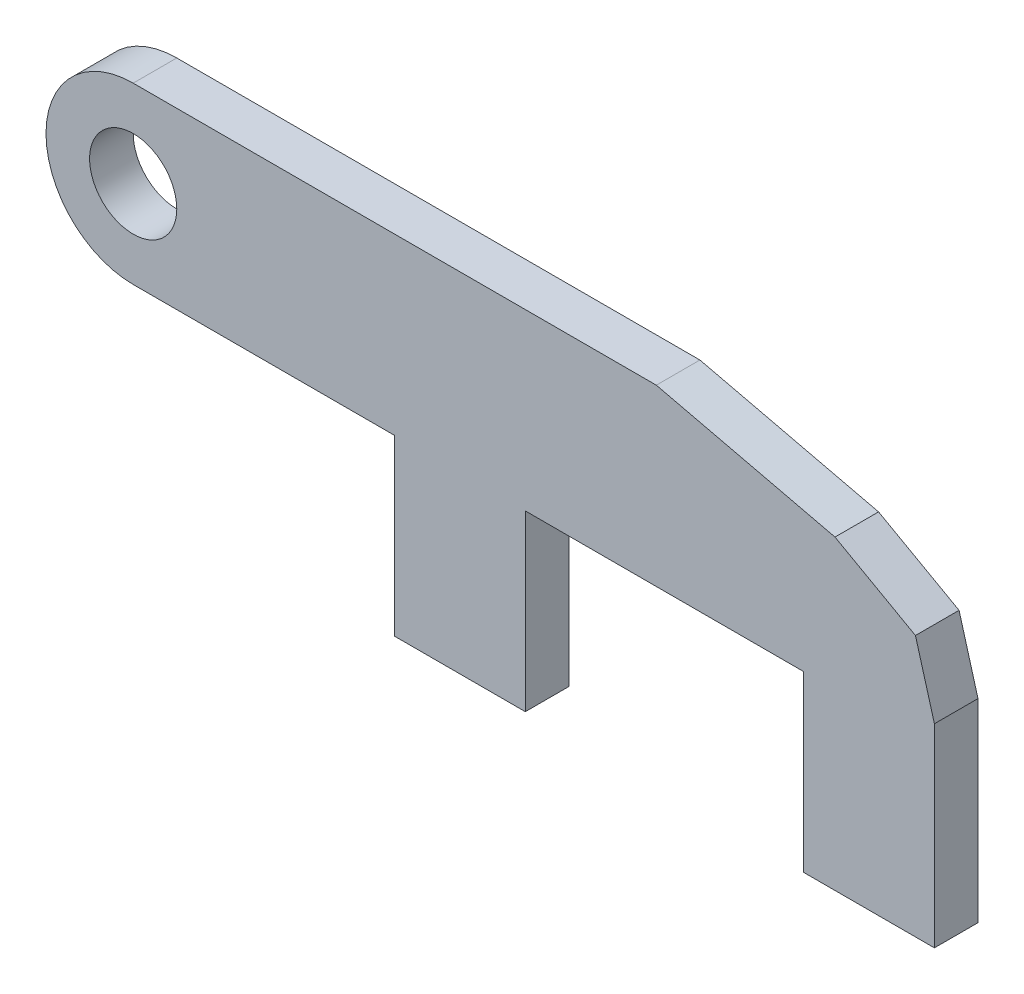
ISO-10303-21;
HEADER;
FILE_DESCRIPTION(('STEP AP214'),'2;1');
FILE_NAME('part.step','',(''),(''),'','','');
FILE_SCHEMA(('AUTOMOTIVE_DESIGN { 1 0 10303 214 1 1 1 1 }'));
ENDSEC;
DATA;
#1=APPLICATION_CONTEXT('core data for automotive mechanical design processes');
#2=APPLICATION_PROTOCOL_DEFINITION('international standard','automotive_design',2000,#1);
#3=PRODUCT_CONTEXT('',#1,'mechanical');
#4=PRODUCT('Part','Part','',(#3));
#5=PRODUCT_RELATED_PRODUCT_CATEGORY('part','',(#4));
#6=PRODUCT_DEFINITION_FORMATION('','',#4);
#7=PRODUCT_DEFINITION_CONTEXT('part definition',#1,'design');
#8=PRODUCT_DEFINITION('design','',#6,#7);
#9=PRODUCT_DEFINITION_SHAPE('','',#8);
#10=(LENGTH_UNIT() NAMED_UNIT(*) SI_UNIT(.MILLI.,.METRE.));
#11=(NAMED_UNIT(*) PLANE_ANGLE_UNIT() SI_UNIT($,.RADIAN.));
#12=(NAMED_UNIT(*) SI_UNIT($,.STERADIAN.) SOLID_ANGLE_UNIT());
#13=UNCERTAINTY_MEASURE_WITH_UNIT(LENGTH_MEASURE(1.E-05),#10,'distance_accuracy_value','');
#14=(GEOMETRIC_REPRESENTATION_CONTEXT(3) GLOBAL_UNCERTAINTY_ASSIGNED_CONTEXT((#13)) GLOBAL_UNIT_ASSIGNED_CONTEXT((#10,
#11,#12)) REPRESENTATION_CONTEXT('',''));
#15=CARTESIAN_POINT('',(0.,0.,0.));
#16=DIRECTION('',(0.,0.,1.));
#17=DIRECTION('',(1.,0.,0.));
#18=AXIS2_PLACEMENT_3D('',#15,#16,#17);
#19=CARTESIAN_POINT('',(0.,10.,5.));
#20=DIRECTION('',(0.,0.,1.));
#21=DIRECTION('',(1.,0.,0.));
#22=AXIS2_PLACEMENT_3D('',#19,#20,#21);
#23=PLANE('',#22);
#24=CARTESIAN_POINT('',(0.,10.,5.));
#25=DIRECTION('',(0.,0.,1.));
#26=DIRECTION('',(1.,0.,0.));
#27=AXIS2_PLACEMENT_3D('',#24,#25,#26);
#28=CIRCLE('',#27,10.);
#29=CARTESIAN_POINT('',(0.,20.,5.));
#30=VERTEX_POINT('',#29);
#31=CARTESIAN_POINT('',(0.,0.,5.));
#32=VERTEX_POINT('',#31);
#33=EDGE_CURVE('E186',#30,#32,#28,.T.);
#34=ORIENTED_EDGE('',*,*,#33,.T.);
#35=DIRECTION('',(1.,0.,0.));
#36=VECTOR('',#35,1.);
#37=CARTESIAN_POINT('',(29.9762595505053,0.,5.));
#38=LINE('',#37,#36);
#39=CARTESIAN_POINT('',(29.9762595505053,0.,5.));
#40=VERTEX_POINT('',#39);
#41=EDGE_CURVE('E109',#32,#40,#38,.T.);
#42=ORIENTED_EDGE('',*,*,#41,.T.);
#43=DIRECTION('',(0.,-1.,0.));
#44=VECTOR('',#43,1.);
#45=CARTESIAN_POINT('',(29.9762595505053,-19.9462860409939,5.));
#46=LINE('',#45,#44);
#47=CARTESIAN_POINT('',(29.9762595505053,-19.9462860409939,5.));
#48=VERTEX_POINT('',#47);
#49=EDGE_CURVE('E216',#40,#48,#46,.T.);
#50=ORIENTED_EDGE('',*,*,#49,.T.);
#51=DIRECTION('',(1.,0.,0.));
#52=VECTOR('',#51,1.);
#53=CARTESIAN_POINT('',(44.9762595505053,-19.9462860409939,5.));
#54=LINE('',#53,#52);
#55=CARTESIAN_POINT('',(44.9762595505053,-19.9462860409939,5.));
#56=VERTEX_POINT('',#55);
#57=EDGE_CURVE('E235',#48,#56,#54,.T.);
#58=ORIENTED_EDGE('',*,*,#57,.T.);
#59=DIRECTION('',(0.,1.,0.));
#60=VECTOR('',#59,1.);
#61=CARTESIAN_POINT('',(44.9762595505053,0.,5.));
#62=LINE('',#61,#60);
#63=CARTESIAN_POINT('',(44.9762595505053,0.,5.));
#64=VERTEX_POINT('',#63);
#65=EDGE_CURVE('E232',#56,#64,#62,.T.);
#66=ORIENTED_EDGE('',*,*,#65,.T.);
#67=DIRECTION('',(1.,0.,0.));
#68=VECTOR('',#67,1.);
#69=CARTESIAN_POINT('',(76.8969693597363,0.,5.));
#70=LINE('',#69,#68);
#71=CARTESIAN_POINT('',(76.8969693597363,0.,5.));
#72=VERTEX_POINT('',#71);
#73=EDGE_CURVE('E234',#64,#72,#70,.T.);
#74=ORIENTED_EDGE('',*,*,#73,.T.);
#75=DIRECTION('',(0.,-1.,0.));
#76=VECTOR('',#75,1.);
#77=CARTESIAN_POINT('',(76.8969693597363,-19.9462860409939,5.));
#78=LINE('',#77,#76);
#79=CARTESIAN_POINT('',(76.8969693597363,-19.9462860409939,5.));
#80=VERTEX_POINT('',#79);
#81=EDGE_CURVE('E237',#72,#80,#78,.T.);
#82=ORIENTED_EDGE('',*,*,#81,.T.);
#83=DIRECTION('',(1.,0.,0.));
#84=VECTOR('',#83,1.);
#85=CARTESIAN_POINT('',(91.8969693597363,-19.9462860409939,5.));
#86=LINE('',#85,#84);
#87=CARTESIAN_POINT('',(91.8969693597363,-19.9462860409939,5.));
#88=VERTEX_POINT('',#87);
#89=EDGE_CURVE('E243',#80,#88,#86,.T.);
#90=ORIENTED_EDGE('',*,*,#89,.T.);
#91=DIRECTION('',(0.,1.,0.));
#92=VECTOR('',#91,1.);
#93=CARTESIAN_POINT('',(91.8969693597363,2.31701265850022,5.));
#94=LINE('',#93,#92);
#95=CARTESIAN_POINT('',(91.8969693597363,2.31701265850022,5.));
#96=VERTEX_POINT('',#95);
#97=EDGE_CURVE('E245',#88,#96,#94,.T.);
#98=ORIENTED_EDGE('',*,*,#97,.T.);
#99=DIRECTION('',(-0.272160563892523,0.96225185240752,0.));
#100=VECTOR('',#99,1.);
#101=CARTESIAN_POINT('',(89.7239351774585,10.,5.));
#102=LINE('',#101,#100);
#103=CARTESIAN_POINT('',(89.7239351774585,10.,5.));
#104=VERTEX_POINT('',#103);
#105=EDGE_CURVE('E143',#96,#104,#102,.T.);
#106=ORIENTED_EDGE('',*,*,#105,.T.);
#107=DIRECTION('',(-0.872861390346621,0.487968229746736,0.));
#108=VECTOR('',#107,1.);
#109=CARTESIAN_POINT('',(80.4934253930056,15.1602643546769,5.));
#110=LINE('',#109,#108);
#111=CARTESIAN_POINT('',(80.4934253930056,15.1602643546769,5.));
#112=VERTEX_POINT('',#111);
#113=EDGE_CURVE('E137',#104,#112,#110,.T.);
#114=ORIENTED_EDGE('',*,*,#113,.T.);
#115=DIRECTION('',(-0.973228871561118,0.229838124687514,0.));
#116=VECTOR('',#115,1.);
#117=CARTESIAN_POINT('',(60.,20.,5.));
#118=LINE('',#117,#116);
#119=CARTESIAN_POINT('',(60.,20.,5.));
#120=VERTEX_POINT('',#119);
#121=EDGE_CURVE('E141',#112,#120,#118,.T.);
#122=ORIENTED_EDGE('',*,*,#121,.T.);
#123=DIRECTION('',(-1.,0.,0.));
#124=VECTOR('',#123,1.);
#125=CARTESIAN_POINT('',(0.,20.,5.));
#126=LINE('',#125,#124);
#127=EDGE_CURVE('E51',#120,#30,#126,.T.);
#128=ORIENTED_EDGE('',*,*,#127,.T.);
#129=EDGE_LOOP('',(#34,#42,#50,#58,#66,#74,#82,#90,#98,#106,#114,#122,#128));
#130=FACE_BOUND('',#129,.T.);
#131=CARTESIAN_POINT('',(0.,10.,5.));
#132=DIRECTION('',(0.,0.,1.));
#133=DIRECTION('',(1.,0.,0.));
#134=AXIS2_PLACEMENT_3D('',#131,#132,#133);
#135=CIRCLE('',#134,5.);
#136=CARTESIAN_POINT('',(5.,10.,5.));
#137=VERTEX_POINT('',#136);
#138=EDGE_CURVE('E165',#137,#137,#135,.T.);
#139=ORIENTED_EDGE('',*,*,#138,.F.);
#140=EDGE_LOOP('',(#139));
#141=FACE_BOUND('',#140,.T.);
#142=ADVANCED_FACE('F34',(#130,#141),#23,.T.);
#143=CARTESIAN_POINT('',(0.,10.,0.));
#144=DIRECTION('',(0.,0.,1.));
#145=DIRECTION('',(1.,0.,0.));
#146=AXIS2_PLACEMENT_3D('',#143,#144,#145);
#147=PLANE('',#146);
#148=CARTESIAN_POINT('',(0.,10.,0.));
#149=DIRECTION('',(0.,0.,1.));
#150=DIRECTION('',(1.,0.,0.));
#151=AXIS2_PLACEMENT_3D('',#148,#149,#150);
#152=CIRCLE('',#151,10.);
#153=CARTESIAN_POINT('',(0.,20.,0.));
#154=VERTEX_POINT('',#153);
#155=CARTESIAN_POINT('',(0.,0.,0.));
#156=VERTEX_POINT('',#155);
#157=EDGE_CURVE('E161',#154,#156,#152,.T.);
#158=ORIENTED_EDGE('',*,*,#157,.F.);
#159=DIRECTION('',(-1.,0.,0.));
#160=VECTOR('',#159,1.);
#161=CARTESIAN_POINT('',(0.,20.,0.));
#162=LINE('',#161,#160);
#163=CARTESIAN_POINT('',(60.,20.,0.));
#164=VERTEX_POINT('',#163);
#165=EDGE_CURVE('E101',#164,#154,#162,.T.);
#166=ORIENTED_EDGE('',*,*,#165,.F.);
#167=DIRECTION('',(-0.973228871561118,0.229838124687514,0.));
#168=VECTOR('',#167,1.);
#169=CARTESIAN_POINT('',(60.,20.,0.));
#170=LINE('',#169,#168);
#171=CARTESIAN_POINT('',(80.4934253930056,15.1602643546769,0.));
#172=VERTEX_POINT('',#171);
#173=EDGE_CURVE('E95',#172,#164,#170,.T.);
#174=ORIENTED_EDGE('',*,*,#173,.F.);
#175=DIRECTION('',(-0.872861390346621,0.487968229746736,0.));
#176=VECTOR('',#175,1.);
#177=CARTESIAN_POINT('',(80.4934253930056,15.1602643546769,0.));
#178=LINE('',#177,#176);
#179=CARTESIAN_POINT('',(89.7239351774585,10.,0.));
#180=VERTEX_POINT('',#179);
#181=EDGE_CURVE('E151',#180,#172,#178,.T.);
#182=ORIENTED_EDGE('',*,*,#181,.F.);
#183=DIRECTION('',(-0.272160563892523,0.96225185240752,0.));
#184=VECTOR('',#183,1.);
#185=CARTESIAN_POINT('',(89.7239351774585,10.,0.));
#186=LINE('',#185,#184);
#187=CARTESIAN_POINT('',(91.8969693597363,2.31701265850022,0.));
#188=VERTEX_POINT('',#187);
#189=EDGE_CURVE('E181',#188,#180,#186,.T.);
#190=ORIENTED_EDGE('',*,*,#189,.F.);
#191=DIRECTION('',(0.,1.,0.));
#192=VECTOR('',#191,1.);
#193=CARTESIAN_POINT('',(91.8969693597363,2.31701265850022,0.));
#194=LINE('',#193,#192);
#195=CARTESIAN_POINT('',(91.8969693597363,-19.9462860409939,0.));
#196=VERTEX_POINT('',#195);
#197=EDGE_CURVE('E179',#196,#188,#194,.T.);
#198=ORIENTED_EDGE('',*,*,#197,.F.);
#199=DIRECTION('',(1.,0.,0.));
#200=VECTOR('',#199,1.);
#201=CARTESIAN_POINT('',(91.8969693597363,-19.9462860409939,0.));
#202=LINE('',#201,#200);
#203=CARTESIAN_POINT('',(76.8969693597363,-19.9462860409939,0.));
#204=VERTEX_POINT('',#203);
#205=EDGE_CURVE('E177',#204,#196,#202,.T.);
#206=ORIENTED_EDGE('',*,*,#205,.F.);
#207=DIRECTION('',(0.,-1.,0.));
#208=VECTOR('',#207,1.);
#209=CARTESIAN_POINT('',(76.8969693597363,-19.9462860409939,0.));
#210=LINE('',#209,#208);
#211=CARTESIAN_POINT('',(76.8969693597363,0.,0.));
#212=VERTEX_POINT('',#211);
#213=EDGE_CURVE('E175',#212,#204,#210,.T.);
#214=ORIENTED_EDGE('',*,*,#213,.F.);
#215=DIRECTION('',(1.,0.,0.));
#216=VECTOR('',#215,1.);
#217=CARTESIAN_POINT('',(76.8969693597363,0.,0.));
#218=LINE('',#217,#216);
#219=CARTESIAN_POINT('',(44.9762595505053,0.,0.));
#220=VERTEX_POINT('',#219);
#221=EDGE_CURVE('E173',#220,#212,#218,.T.);
#222=ORIENTED_EDGE('',*,*,#221,.F.);
#223=DIRECTION('',(0.,1.,0.));
#224=VECTOR('',#223,1.);
#225=CARTESIAN_POINT('',(44.9762595505053,0.,0.));
#226=LINE('',#225,#224);
#227=CARTESIAN_POINT('',(44.9762595505053,-19.9462860409939,0.));
#228=VERTEX_POINT('',#227);
#229=EDGE_CURVE('E171',#228,#220,#226,.T.);
#230=ORIENTED_EDGE('',*,*,#229,.F.);
#231=DIRECTION('',(1.,0.,0.));
#232=VECTOR('',#231,1.);
#233=CARTESIAN_POINT('',(44.9762595505053,-19.9462860409939,0.));
#234=LINE('',#233,#232);
#235=CARTESIAN_POINT('',(29.9762595505053,-19.9462860409939,0.));
#236=VERTEX_POINT('',#235);
#237=EDGE_CURVE('E169',#236,#228,#234,.T.);
#238=ORIENTED_EDGE('',*,*,#237,.F.);
#239=DIRECTION('',(0.,-1.,0.));
#240=VECTOR('',#239,1.);
#241=CARTESIAN_POINT('',(29.9762595505053,-19.9462860409939,0.));
#242=LINE('',#241,#240);
#243=CARTESIAN_POINT('',(29.9762595505053,0.,0.));
#244=VERTEX_POINT('',#243);
#245=EDGE_CURVE('E167',#244,#236,#242,.T.);
#246=ORIENTED_EDGE('',*,*,#245,.F.);
#247=DIRECTION('',(1.,0.,0.));
#248=VECTOR('',#247,1.);
#249=CARTESIAN_POINT('',(29.9762595505053,0.,0.));
#250=LINE('',#249,#248);
#251=EDGE_CURVE('E164',#156,#244,#250,.T.);
#252=ORIENTED_EDGE('',*,*,#251,.F.);
#253=EDGE_LOOP('',(#158,#166,#174,#182,#190,#198,#206,#214,#222,#230,#238,#246,#252));
#254=FACE_BOUND('',#253,.T.);
#255=CARTESIAN_POINT('',(0.,10.,0.));
#256=DIRECTION('',(0.,0.,1.));
#257=DIRECTION('',(1.,0.,0.));
#258=AXIS2_PLACEMENT_3D('',#255,#256,#257);
#259=CIRCLE('',#258,5.);
#260=CARTESIAN_POINT('',(5.,10.,0.));
#261=VERTEX_POINT('',#260);
#262=EDGE_CURVE('E435',#261,#261,#259,.T.);
#263=ORIENTED_EDGE('',*,*,#262,.T.);
#264=EDGE_LOOP('',(#263));
#265=FACE_BOUND('',#264,.T.);
#266=ADVANCED_FACE('F220',(#254,#265),#147,.F.);
#267=CARTESIAN_POINT('',(0.,10.,5.));
#268=DIRECTION('',(0.,0.,-1.));
#269=DIRECTION('',(-1.,0.,0.));
#270=AXIS2_PLACEMENT_3D('',#267,#268,#269);
#271=CYLINDRICAL_SURFACE('',#270,10.);
#272=ORIENTED_EDGE('',*,*,#157,.T.);
#273=DIRECTION('',(0.,0.,-1.));
#274=VECTOR('',#273,1.);
#275=CARTESIAN_POINT('',(0.,0.,5.));
#276=LINE('',#275,#274);
#277=EDGE_CURVE('E11',#32,#156,#276,.T.);
#278=ORIENTED_EDGE('',*,*,#277,.F.);
#279=ORIENTED_EDGE('',*,*,#33,.F.);
#280=DIRECTION('',(0.,0.,-1.));
#281=VECTOR('',#280,1.);
#282=CARTESIAN_POINT('',(0.,20.,5.));
#283=LINE('',#282,#281);
#284=EDGE_CURVE('E157',#30,#154,#283,.T.);
#285=ORIENTED_EDGE('',*,*,#284,.T.);
#286=EDGE_LOOP('',(#272,#278,#279,#285));
#287=FACE_BOUND('',#286,.T.);
#288=ADVANCED_FACE('F36',(#287),#271,.T.);
#289=CARTESIAN_POINT('',(29.9762595505053,0.,5.));
#290=DIRECTION('',(0.,1.,0.));
#291=DIRECTION('',(0.,0.,1.));
#292=AXIS2_PLACEMENT_3D('',#289,#290,#291);
#293=PLANE('',#292);
#294=ORIENTED_EDGE('',*,*,#251,.T.);
#295=DIRECTION('',(0.,0.,-1.));
#296=VECTOR('',#295,1.);
#297=CARTESIAN_POINT('',(29.9762595505053,0.,5.));
#298=LINE('',#297,#296);
#299=EDGE_CURVE('E43',#40,#244,#298,.T.);
#300=ORIENTED_EDGE('',*,*,#299,.F.);
#301=ORIENTED_EDGE('',*,*,#41,.F.);
#302=ORIENTED_EDGE('',*,*,#277,.T.);
#303=EDGE_LOOP('',(#294,#300,#301,#302));
#304=FACE_BOUND('',#303,.T.);
#305=ADVANCED_FACE('F279',(#304),#293,.F.);
#306=CARTESIAN_POINT('',(29.9762595505053,-19.9462860409939,5.));
#307=DIRECTION('',(1.,0.,0.));
#308=DIRECTION('',(0.,0.,-1.));
#309=AXIS2_PLACEMENT_3D('',#306,#307,#308);
#310=PLANE('',#309);
#311=ORIENTED_EDGE('',*,*,#245,.T.);
#312=DIRECTION('',(0.,0.,-1.));
#313=VECTOR('',#312,1.);
#314=CARTESIAN_POINT('',(29.9762595505053,-19.9462860409939,5.));
#315=LINE('',#314,#313);
#316=EDGE_CURVE('E208',#48,#236,#315,.T.);
#317=ORIENTED_EDGE('',*,*,#316,.F.);
#318=ORIENTED_EDGE('',*,*,#49,.F.);
#319=ORIENTED_EDGE('',*,*,#299,.T.);
#320=EDGE_LOOP('',(#311,#317,#318,#319));
#321=FACE_BOUND('',#320,.T.);
#322=ADVANCED_FACE('F214',(#321),#310,.F.);
#323=CARTESIAN_POINT('',(44.9762595505053,-19.9462860409939,5.));
#324=DIRECTION('',(0.,1.,0.));
#325=DIRECTION('',(-1.,0.,0.));
#326=AXIS2_PLACEMENT_3D('',#323,#324,#325);
#327=PLANE('',#326);
#328=ORIENTED_EDGE('',*,*,#237,.T.);
#329=DIRECTION('',(0.,0.,-1.));
#330=VECTOR('',#329,1.);
#331=CARTESIAN_POINT('',(44.9762595505053,-19.9462860409939,5.));
#332=LINE('',#331,#330);
#333=EDGE_CURVE('E205',#56,#228,#332,.T.);
#334=ORIENTED_EDGE('',*,*,#333,.F.);
#335=ORIENTED_EDGE('',*,*,#57,.F.);
#336=ORIENTED_EDGE('',*,*,#316,.T.);
#337=EDGE_LOOP('',(#328,#334,#335,#336));
#338=FACE_BOUND('',#337,.T.);
#339=ADVANCED_FACE('F226',(#338),#327,.F.);
#340=CARTESIAN_POINT('',(44.9762595505053,0.,5.));
#341=DIRECTION('',(-1.,0.,0.));
#342=DIRECTION('',(0.,0.,1.));
#343=AXIS2_PLACEMENT_3D('',#340,#341,#342);
#344=PLANE('',#343);
#345=ORIENTED_EDGE('',*,*,#229,.T.);
#346=DIRECTION('',(0.,0.,-1.));
#347=VECTOR('',#346,1.);
#348=CARTESIAN_POINT('',(44.9762595505053,0.,5.));
#349=LINE('',#348,#347);
#350=EDGE_CURVE('E202',#64,#220,#349,.T.);
#351=ORIENTED_EDGE('',*,*,#350,.F.);
#352=ORIENTED_EDGE('',*,*,#65,.F.);
#353=ORIENTED_EDGE('',*,*,#333,.T.);
#354=EDGE_LOOP('',(#345,#351,#352,#353));
#355=FACE_BOUND('',#354,.T.);
#356=ADVANCED_FACE('F230',(#355),#344,.F.);
#357=CARTESIAN_POINT('',(76.8969693597363,0.,5.));
#358=DIRECTION('',(0.,1.,0.));
#359=DIRECTION('',(-1.,0.,0.));
#360=AXIS2_PLACEMENT_3D('',#357,#358,#359);
#361=PLANE('',#360);
#362=ORIENTED_EDGE('',*,*,#221,.T.);
#363=DIRECTION('',(0.,0.,-1.));
#364=VECTOR('',#363,1.);
#365=CARTESIAN_POINT('',(76.8969693597363,0.,5.));
#366=LINE('',#365,#364);
#367=EDGE_CURVE('E199',#72,#212,#366,.T.);
#368=ORIENTED_EDGE('',*,*,#367,.F.);
#369=ORIENTED_EDGE('',*,*,#73,.F.);
#370=ORIENTED_EDGE('',*,*,#350,.T.);
#371=EDGE_LOOP('',(#362,#368,#369,#370));
#372=FACE_BOUND('',#371,.T.);
#373=ADVANCED_FACE('F292',(#372),#361,.F.);
#374=CARTESIAN_POINT('',(76.8969693597363,-19.9462860409939,5.));
#375=DIRECTION('',(1.,0.,0.));
#376=DIRECTION('',(0.,0.,-1.));
#377=AXIS2_PLACEMENT_3D('',#374,#375,#376);
#378=PLANE('',#377);
#379=ORIENTED_EDGE('',*,*,#213,.T.);
#380=DIRECTION('',(0.,0.,-1.));
#381=VECTOR('',#380,1.);
#382=CARTESIAN_POINT('',(76.8969693597363,-19.9462860409939,5.));
#383=LINE('',#382,#381);
#384=EDGE_CURVE('E196',#80,#204,#383,.T.);
#385=ORIENTED_EDGE('',*,*,#384,.F.);
#386=ORIENTED_EDGE('',*,*,#81,.F.);
#387=ORIENTED_EDGE('',*,*,#367,.T.);
#388=EDGE_LOOP('',(#379,#385,#386,#387));
#389=FACE_BOUND('',#388,.T.);
#390=ADVANCED_FACE('F295',(#389),#378,.F.);
#391=CARTESIAN_POINT('',(91.8969693597363,-19.9462860409939,5.));
#392=DIRECTION('',(0.,1.,0.));
#393=DIRECTION('',(-1.,0.,0.));
#394=AXIS2_PLACEMENT_3D('',#391,#392,#393);
#395=PLANE('',#394);
#396=ORIENTED_EDGE('',*,*,#205,.T.);
#397=DIRECTION('',(0.,0.,-1.));
#398=VECTOR('',#397,1.);
#399=CARTESIAN_POINT('',(91.8969693597363,-19.9462860409939,5.));
#400=LINE('',#399,#398);
#401=EDGE_CURVE('E193',#88,#196,#400,.T.);
#402=ORIENTED_EDGE('',*,*,#401,.F.);
#403=ORIENTED_EDGE('',*,*,#89,.F.);
#404=ORIENTED_EDGE('',*,*,#384,.T.);
#405=EDGE_LOOP('',(#396,#402,#403,#404));
#406=FACE_BOUND('',#405,.T.);
#407=ADVANCED_FACE('F299',(#406),#395,.F.);
#408=CARTESIAN_POINT('',(91.8969693597363,2.31701265850022,5.));
#409=DIRECTION('',(-1.,0.,0.));
#410=DIRECTION('',(0.,0.,1.));
#411=AXIS2_PLACEMENT_3D('',#408,#409,#410);
#412=PLANE('',#411);
#413=ORIENTED_EDGE('',*,*,#197,.T.);
#414=DIRECTION('',(0.,0.,-1.));
#415=VECTOR('',#414,1.);
#416=CARTESIAN_POINT('',(91.8969693597363,2.31701265850022,5.));
#417=LINE('',#416,#415);
#418=EDGE_CURVE('E190',#96,#188,#417,.T.);
#419=ORIENTED_EDGE('',*,*,#418,.F.);
#420=ORIENTED_EDGE('',*,*,#97,.F.);
#421=ORIENTED_EDGE('',*,*,#401,.T.);
#422=EDGE_LOOP('',(#413,#419,#420,#421));
#423=FACE_BOUND('',#422,.T.);
#424=ADVANCED_FACE('F251',(#423),#412,.F.);
#425=CARTESIAN_POINT('',(89.7239351774585,10.,5.));
#426=DIRECTION('',(-0.96225185240752,-0.272160563892523,0.));
#427=DIRECTION('',(0.272160563892523,-0.96225185240752,0.));
#428=AXIS2_PLACEMENT_3D('',#425,#426,#427);
#429=PLANE('',#428);
#430=ORIENTED_EDGE('',*,*,#189,.T.);
#431=DIRECTION('',(0.,0.,-1.));
#432=VECTOR('',#431,1.);
#433=CARTESIAN_POINT('',(89.7239351774585,10.,5.));
#434=LINE('',#433,#432);
#435=EDGE_CURVE('E152',#104,#180,#434,.T.);
#436=ORIENTED_EDGE('',*,*,#435,.F.);
#437=ORIENTED_EDGE('',*,*,#105,.F.);
#438=ORIENTED_EDGE('',*,*,#418,.T.);
#439=EDGE_LOOP('',(#430,#436,#437,#438));
#440=FACE_BOUND('',#439,.T.);
#441=ADVANCED_FACE('F255',(#440),#429,.F.);
#442=CARTESIAN_POINT('',(80.4934253930056,15.1602643546769,5.));
#443=DIRECTION('',(-0.487968229746736,-0.872861390346621,0.));
#444=DIRECTION('',(0.872861390346621,-0.487968229746736,0.));
#445=AXIS2_PLACEMENT_3D('',#442,#443,#444);
#446=PLANE('',#445);
#447=ORIENTED_EDGE('',*,*,#181,.T.);
#448=DIRECTION('',(0.,0.,-1.));
#449=VECTOR('',#448,1.);
#450=CARTESIAN_POINT('',(80.4934253930056,15.1602643546769,5.));
#451=LINE('',#450,#449);
#452=EDGE_CURVE('E148',#112,#172,#451,.T.);
#453=ORIENTED_EDGE('',*,*,#452,.F.);
#454=ORIENTED_EDGE('',*,*,#113,.F.);
#455=ORIENTED_EDGE('',*,*,#435,.T.);
#456=EDGE_LOOP('',(#447,#453,#454,#455));
#457=FACE_BOUND('',#456,.T.);
#458=ADVANCED_FACE('F149',(#457),#446,.F.);
#459=CARTESIAN_POINT('',(60.,20.,5.));
#460=DIRECTION('',(-0.229838124687514,-0.973228871561118,0.));
#461=DIRECTION('',(0.973228871561118,-0.229838124687514,0.));
#462=AXIS2_PLACEMENT_3D('',#459,#460,#461);
#463=PLANE('',#462);
#464=ORIENTED_EDGE('',*,*,#173,.T.);
#465=DIRECTION('',(0.,0.,-1.));
#466=VECTOR('',#465,1.);
#467=CARTESIAN_POINT('',(60.,20.,5.));
#468=LINE('',#467,#466);
#469=EDGE_CURVE('E153',#120,#164,#468,.T.);
#470=ORIENTED_EDGE('',*,*,#469,.F.);
#471=ORIENTED_EDGE('',*,*,#121,.F.);
#472=ORIENTED_EDGE('',*,*,#452,.T.);
#473=EDGE_LOOP('',(#464,#470,#471,#472));
#474=FACE_BOUND('',#473,.T.);
#475=ADVANCED_FACE('F155',(#474),#463,.F.);
#476=CARTESIAN_POINT('',(0.,20.,5.));
#477=DIRECTION('',(0.,-1.,0.));
#478=DIRECTION('',(0.,0.,-1.));
#479=AXIS2_PLACEMENT_3D('',#476,#477,#478);
#480=PLANE('',#479);
#481=ORIENTED_EDGE('',*,*,#165,.T.);
#482=ORIENTED_EDGE('',*,*,#284,.F.);
#483=ORIENTED_EDGE('',*,*,#127,.F.);
#484=ORIENTED_EDGE('',*,*,#469,.T.);
#485=EDGE_LOOP('',(#481,#482,#483,#484));
#486=FACE_BOUND('',#485,.T.);
#487=ADVANCED_FACE('F259',(#486),#480,.F.);
#488=CARTESIAN_POINT('',(0.,10.,5.));
#489=DIRECTION('',(0.,0.,-1.));
#490=DIRECTION('',(-1.,0.,0.));
#491=AXIS2_PLACEMENT_3D('',#488,#489,#490);
#492=CYLINDRICAL_SURFACE('',#491,5.);
#493=ORIENTED_EDGE('',*,*,#138,.T.);
#494=EDGE_LOOP('',(#493));
#495=FACE_BOUND('',#494,.T.);
#496=ORIENTED_EDGE('',*,*,#262,.F.);
#497=EDGE_LOOP('',(#496));
#498=FACE_BOUND('',#497,.T.);
#499=ADVANCED_FACE('F261',(#495,#498),#492,.F.);
#500=CLOSED_SHELL('',(#142,#266,#288,#305,#322,#339,#356,#373,#390,#407,#424,#441,#458,#475,
#487,#499));
#501=MANIFOLD_SOLID_BREP('B2',#500);
#502=ADVANCED_BREP_SHAPE_REPRESENTATION('',(#18,#501),#14);
#503=SHAPE_DEFINITION_REPRESENTATION(#9,#502);
ENDSEC;
END-ISO-10303-21;
